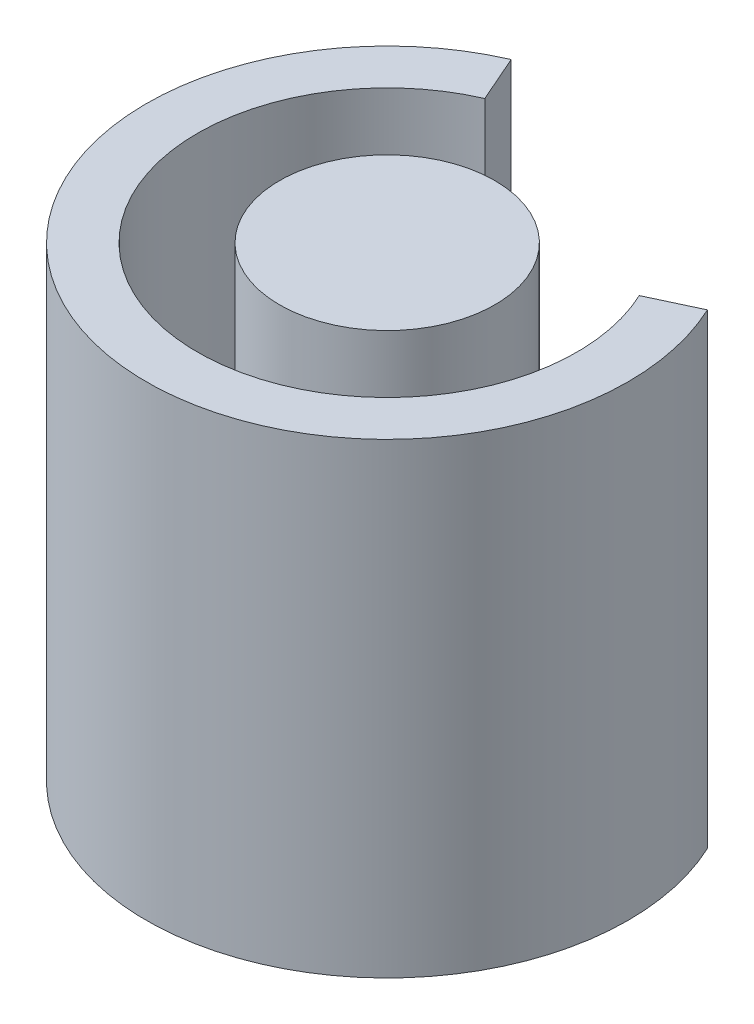
ISO-10303-21;
HEADER;
FILE_DESCRIPTION(('STEP AP214'),'2;1');
FILE_NAME('part.step','',(''),(''),'','','');
FILE_SCHEMA(('AUTOMOTIVE_DESIGN { 1 0 10303 214 1 1 1 1 }'));
ENDSEC;
DATA;
#1=APPLICATION_CONTEXT('core data for automotive mechanical design processes');
#2=APPLICATION_PROTOCOL_DEFINITION('international standard','automotive_design',2000,#1);
#3=PRODUCT_CONTEXT('',#1,'mechanical');
#4=PRODUCT('Part','Part','',(#3));
#5=PRODUCT_RELATED_PRODUCT_CATEGORY('part','',(#4));
#6=PRODUCT_DEFINITION_FORMATION('','',#4);
#7=PRODUCT_DEFINITION_CONTEXT('part definition',#1,'design');
#8=PRODUCT_DEFINITION('design','',#6,#7);
#9=PRODUCT_DEFINITION_SHAPE('','',#8);
#10=(LENGTH_UNIT() NAMED_UNIT(*) SI_UNIT(.MILLI.,.METRE.));
#11=(NAMED_UNIT(*) PLANE_ANGLE_UNIT() SI_UNIT($,.RADIAN.));
#12=(NAMED_UNIT(*) SI_UNIT($,.STERADIAN.) SOLID_ANGLE_UNIT());
#13=UNCERTAINTY_MEASURE_WITH_UNIT(LENGTH_MEASURE(1.E-05),#10,'distance_accuracy_value','');
#14=(GEOMETRIC_REPRESENTATION_CONTEXT(3) GLOBAL_UNCERTAINTY_ASSIGNED_CONTEXT((#13)) GLOBAL_UNIT_ASSIGNED_CONTEXT((#10,
#11,#12)) REPRESENTATION_CONTEXT('',''));
#15=CARTESIAN_POINT('',(0.,0.,0.));
#16=DIRECTION('',(0.,0.,1.));
#17=DIRECTION('',(1.,0.,0.));
#18=AXIS2_PLACEMENT_3D('',#15,#16,#17);
#19=CARTESIAN_POINT('',(-33.2300000000001,32.31,-25.27));
#20=DIRECTION('',(0.,1.,0.));
#21=DIRECTION('',(0.,0.,1.));
#22=AXIS2_PLACEMENT_3D('',#19,#20,#21);
#23=CYLINDRICAL_SURFACE('',#22,2.1);
#24=CARTESIAN_POINT('',(-33.2300000000001,32.31,-25.27));
#25=DIRECTION('',(0.,1.,0.));
#26=DIRECTION('',(0.,0.,1.));
#27=AXIS2_PLACEMENT_3D('',#24,#25,#26);
#28=CIRCLE('',#27,2.1);
#29=CARTESIAN_POINT('',(-33.2300000000001,32.31,-23.17));
#30=VERTEX_POINT('',#29);
#31=EDGE_CURVE('E11',#30,#30,#28,.T.);
#32=ORIENTED_EDGE('',*,*,#31,.T.);
#33=EDGE_LOOP('',(#32));
#34=FACE_BOUND('',#33,.T.);
#35=CARTESIAN_POINT('',(-33.2300000000001,40.5,-25.27));
#36=DIRECTION('',(0.,1.,0.));
#37=DIRECTION('',(0.,0.,1.));
#38=AXIS2_PLACEMENT_3D('',#35,#36,#37);
#39=CIRCLE('',#38,2.1);
#40=CARTESIAN_POINT('',(-33.2300000000001,40.5,-23.17));
#41=VERTEX_POINT('',#40);
#42=EDGE_CURVE('E46',#41,#41,#39,.T.);
#43=ORIENTED_EDGE('',*,*,#42,.F.);
#44=EDGE_LOOP('',(#43));
#45=FACE_BOUND('',#44,.T.);
#46=ADVANCED_FACE('F43',(#34,#45),#23,.T.);
#47=CARTESIAN_POINT('',(-33.2300000000001,32.31,-25.27));
#48=DIRECTION('',(0.,1.,0.));
#49=DIRECTION('',(0.,0.,1.));
#50=AXIS2_PLACEMENT_3D('',#47,#48,#49);
#51=PLANE('',#50);
#52=ORIENTED_EDGE('',*,*,#31,.F.);
#53=EDGE_LOOP('',(#52));
#54=FACE_BOUND('',#53,.T.);
#55=ADVANCED_FACE('F58',(#54),#51,.F.);
#56=CARTESIAN_POINT('',(-33.2300000000001,40.5,-25.27));
#57=DIRECTION('',(0.,1.,0.));
#58=DIRECTION('',(0.,0.,1.));
#59=AXIS2_PLACEMENT_3D('',#56,#57,#58);
#60=PLANE('',#59);
#61=ORIENTED_EDGE('',*,*,#42,.T.);
#62=EDGE_LOOP('',(#61));
#63=FACE_BOUND('',#62,.T.);
#64=ADVANCED_FACE('F55',(#63),#60,.T.);
#65=CLOSED_SHELL('',(#46,#55,#64));
#66=MANIFOLD_SOLID_BREP('B2',#65);
#67=CARTESIAN_POINT('',(-33.2300000000001,31.4,-25.27));
#68=DIRECTION('',(0.,1.,0.));
#69=DIRECTION('',(0.,0.,1.));
#70=AXIS2_PLACEMENT_3D('',#67,#68,#69);
#71=CYLINDRICAL_SURFACE('',#70,4.7);
#72=CARTESIAN_POINT('',(-33.2300000000001,40.5,-25.27));
#73=DIRECTION('',(0.,1.,0.));
#74=DIRECTION('',(1.,0.,0.));
#75=AXIS2_PLACEMENT_3D('',#72,#73,#74);
#76=CIRCLE('',#75,4.7);
#77=CARTESIAN_POINT('',(-35.1159487049057,40.5,-29.57502003276));
#78=VERTEX_POINT('',#77);
#79=CARTESIAN_POINT('',(-28.9714646423472,40.5,-27.2586871567998));
#80=VERTEX_POINT('',#79);
#81=EDGE_CURVE('E149',#78,#80,#76,.T.);
#82=ORIENTED_EDGE('',*,*,#81,.F.);
#83=DIRECTION('',(0.,1.,0.));
#84=VECTOR('',#83,1.);
#85=CARTESIAN_POINT('',(-35.1159487049057,31.4,-29.57502003276));
#86=LINE('',#85,#84);
#87=CARTESIAN_POINT('',(-35.1159487049057,31.4,-29.57502003276));
#88=VERTEX_POINT('',#87);
#89=EDGE_CURVE('E41',#88,#78,#86,.T.);
#90=ORIENTED_EDGE('',*,*,#89,.F.);
#91=CARTESIAN_POINT('',(-33.2300000000001,31.4,-25.27));
#92=DIRECTION('',(0.,1.,0.));
#93=DIRECTION('',(1.,0.,0.));
#94=AXIS2_PLACEMENT_3D('',#91,#92,#93);
#95=CIRCLE('',#94,4.7);
#96=CARTESIAN_POINT('',(-28.9714646423472,31.4,-27.2586871567998));
#97=VERTEX_POINT('',#96);
#98=EDGE_CURVE('E144',#88,#97,#95,.T.);
#99=ORIENTED_EDGE('',*,*,#98,.T.);
#100=DIRECTION('',(0.,1.,0.));
#101=VECTOR('',#100,1.);
#102=CARTESIAN_POINT('',(-28.9714646423472,31.4,-27.2586871567998));
#103=LINE('',#102,#101);
#104=EDGE_CURVE('E87',#97,#80,#103,.T.);
#105=ORIENTED_EDGE('',*,*,#104,.T.);
#106=EDGE_LOOP('',(#82,#90,#99,#105));
#107=FACE_BOUND('',#106,.T.);
#108=ADVANCED_FACE('F84',(#107),#71,.T.);
#109=CARTESIAN_POINT('',(-35.1159487049057,31.4,-29.57502003276));
#110=DIRECTION('',(-0.915961709097871,0.,0.40126568189481));
#111=DIRECTION('',(0.40126568189481,0.,0.915961709097871));
#112=AXIS2_PLACEMENT_3D('',#109,#110,#111);
#113=PLANE('',#112);
#114=DIRECTION('',(0.40126568189481,0.,0.915961709097871));
#115=VECTOR('',#114,1.);
#116=CARTESIAN_POINT('',(-35.1159487049057,40.5,-29.57502003276));
#117=LINE('',#116,#115);
#118=CARTESIAN_POINT('',(-34.7146830230108,40.5,-28.6590583236621));
#119=VERTEX_POINT('',#118);
#120=EDGE_CURVE('E117',#78,#119,#117,.T.);
#121=ORIENTED_EDGE('',*,*,#120,.T.);
#122=DIRECTION('',(0.,1.,0.));
#123=VECTOR('',#122,1.);
#124=CARTESIAN_POINT('',(-34.7146830230108,31.4,-28.6590583236621));
#125=LINE('',#124,#123);
#126=CARTESIAN_POINT('',(-34.7146830230108,31.4,-28.6590583236621));
#127=VERTEX_POINT('',#126);
#128=EDGE_CURVE('E93',#127,#119,#125,.T.);
#129=ORIENTED_EDGE('',*,*,#128,.F.);
#130=DIRECTION('',(0.40126568189481,0.,0.915961709097871));
#131=VECTOR('',#130,1.);
#132=CARTESIAN_POINT('',(-35.1159487049057,31.4,-29.57502003276));
#133=LINE('',#132,#131);
#134=EDGE_CURVE('E132',#88,#127,#133,.T.);
#135=ORIENTED_EDGE('',*,*,#134,.F.);
#136=ORIENTED_EDGE('',*,*,#89,.T.);
#137=EDGE_LOOP('',(#121,#129,#135,#136));
#138=FACE_BOUND('',#137,.T.);
#139=ADVANCED_FACE('F159',(#138),#113,.F.);
#140=CARTESIAN_POINT('',(-33.2300000000001,31.4,-25.27));
#141=DIRECTION('',(0.,1.,0.));
#142=DIRECTION('',(0.,0.,1.));
#143=AXIS2_PLACEMENT_3D('',#140,#141,#142);
#144=CYLINDRICAL_SURFACE('',#143,3.7);
#145=CARTESIAN_POINT('',(-33.2300000000001,40.5,-25.27));
#146=DIRECTION('',(0.,1.,0.));
#147=DIRECTION('',(0.,0.,1.));
#148=AXIS2_PLACEMENT_3D('',#145,#146,#147);
#149=CIRCLE('',#148,3.7);
#150=CARTESIAN_POINT('',(-29.8775359950393,40.5,-26.8355622298211));
#151=VERTEX_POINT('',#150);
#152=EDGE_CURVE('E139',#119,#151,#149,.T.);
#153=ORIENTED_EDGE('',*,*,#152,.T.);
#154=DIRECTION('',(0.,1.,0.));
#155=VECTOR('',#154,1.);
#156=CARTESIAN_POINT('',(-29.8775359950393,31.4,-26.8355622298211));
#157=LINE('',#156,#155);
#158=CARTESIAN_POINT('',(-29.8775359950393,31.4,-26.8355622298211));
#159=VERTEX_POINT('',#158);
#160=EDGE_CURVE('E136',#159,#151,#157,.T.);
#161=ORIENTED_EDGE('',*,*,#160,.F.);
#162=CARTESIAN_POINT('',(-33.2300000000001,31.4,-25.27));
#163=DIRECTION('',(0.,1.,0.));
#164=DIRECTION('',(0.,0.,1.));
#165=AXIS2_PLACEMENT_3D('',#162,#163,#164);
#166=CIRCLE('',#165,3.7);
#167=EDGE_CURVE('E129',#127,#159,#166,.T.);
#168=ORIENTED_EDGE('',*,*,#167,.F.);
#169=ORIENTED_EDGE('',*,*,#128,.T.);
#170=EDGE_LOOP('',(#153,#161,#168,#169));
#171=FACE_BOUND('',#170,.T.);
#172=ADVANCED_FACE('F137',(#171),#144,.F.);
#173=CARTESIAN_POINT('',(-29.8775359950393,31.4,-26.8355622298211));
#174=DIRECTION('',(0.423124926978679,0.,0.906071352692098));
#175=DIRECTION('',(0.906071352692098,0.,-0.423124926978679));
#176=AXIS2_PLACEMENT_3D('',#173,#174,#175);
#177=PLANE('',#176);
#178=DIRECTION('',(0.906071352692098,0.,-0.423124926978679));
#179=VECTOR('',#178,1.);
#180=CARTESIAN_POINT('',(-29.8775359950393,40.5,-26.8355622298211));
#181=LINE('',#180,#179);
#182=EDGE_CURVE('E152',#151,#80,#181,.T.);
#183=ORIENTED_EDGE('',*,*,#182,.T.);
#184=ORIENTED_EDGE('',*,*,#104,.F.);
#185=DIRECTION('',(0.906071352692098,0.,-0.423124926978679));
#186=VECTOR('',#185,1.);
#187=CARTESIAN_POINT('',(-29.8775359950393,31.4,-26.8355622298211));
#188=LINE('',#187,#186);
#189=EDGE_CURVE('E126',#159,#97,#188,.T.);
#190=ORIENTED_EDGE('',*,*,#189,.F.);
#191=ORIENTED_EDGE('',*,*,#160,.T.);
#192=EDGE_LOOP('',(#183,#184,#190,#191));
#193=FACE_BOUND('',#192,.T.);
#194=ADVANCED_FACE('F143',(#193),#177,.F.);
#195=CARTESIAN_POINT('',(-33.2300000000001,31.4,-25.27));
#196=DIRECTION('',(0.,1.,0.));
#197=DIRECTION('',(1.,0.,0.));
#198=AXIS2_PLACEMENT_3D('',#195,#196,#197);
#199=PLANE('',#198);
#200=ORIENTED_EDGE('',*,*,#98,.F.);
#201=ORIENTED_EDGE('',*,*,#134,.T.);
#202=ORIENTED_EDGE('',*,*,#167,.T.);
#203=ORIENTED_EDGE('',*,*,#189,.T.);
#204=EDGE_LOOP('',(#200,#201,#202,#203));
#205=FACE_BOUND('',#204,.T.);
#206=ADVANCED_FACE('F131',(#205),#199,.F.);
#207=CARTESIAN_POINT('',(-33.2300000000001,40.5,-25.27));
#208=DIRECTION('',(0.,1.,0.));
#209=DIRECTION('',(1.,0.,0.));
#210=AXIS2_PLACEMENT_3D('',#207,#208,#209);
#211=PLANE('',#210);
#212=ORIENTED_EDGE('',*,*,#81,.T.);
#213=ORIENTED_EDGE('',*,*,#182,.F.);
#214=ORIENTED_EDGE('',*,*,#152,.F.);
#215=ORIENTED_EDGE('',*,*,#120,.F.);
#216=EDGE_LOOP('',(#212,#213,#214,#215));
#217=FACE_BOUND('',#216,.T.);
#218=ADVANCED_FACE('F157',(#217),#211,.T.);
#219=CLOSED_SHELL('',(#108,#139,#172,#194,#206,#218));
#220=MANIFOLD_SOLID_BREP('B6',#219);
#221=ADVANCED_BREP_SHAPE_REPRESENTATION('',(#18,#66,#220),#14);
#222=SHAPE_DEFINITION_REPRESENTATION(#9,#221);
ENDSEC;
END-ISO-10303-21;
